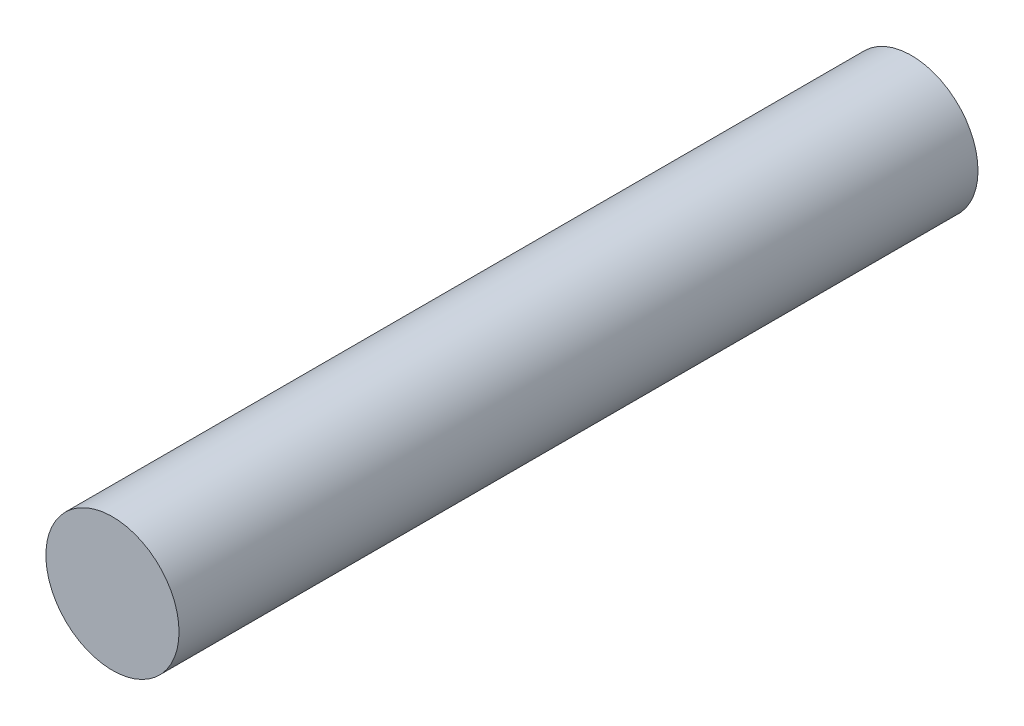
ISO-10303-21;
HEADER;
FILE_DESCRIPTION(('STEP AP214'),'2;1');
FILE_NAME('part.step','',(''),(''),'','','');
FILE_SCHEMA(('AUTOMOTIVE_DESIGN { 1 0 10303 214 1 1 1 1 }'));
ENDSEC;
DATA;
#1=APPLICATION_CONTEXT('core data for automotive mechanical design processes');
#2=APPLICATION_PROTOCOL_DEFINITION('international standard','automotive_design',2000,#1);
#3=PRODUCT_CONTEXT('',#1,'mechanical');
#4=PRODUCT('Part','Part','',(#3));
#5=PRODUCT_RELATED_PRODUCT_CATEGORY('part','',(#4));
#6=PRODUCT_DEFINITION_FORMATION('','',#4);
#7=PRODUCT_DEFINITION_CONTEXT('part definition',#1,'design');
#8=PRODUCT_DEFINITION('design','',#6,#7);
#9=PRODUCT_DEFINITION_SHAPE('','',#8);
#10=(LENGTH_UNIT() NAMED_UNIT(*) SI_UNIT(.MILLI.,.METRE.));
#11=(NAMED_UNIT(*) PLANE_ANGLE_UNIT() SI_UNIT($,.RADIAN.));
#12=(NAMED_UNIT(*) SI_UNIT($,.STERADIAN.) SOLID_ANGLE_UNIT());
#13=UNCERTAINTY_MEASURE_WITH_UNIT(LENGTH_MEASURE(1.E-05),#10,'distance_accuracy_value','');
#14=(GEOMETRIC_REPRESENTATION_CONTEXT(3) GLOBAL_UNCERTAINTY_ASSIGNED_CONTEXT((#13)) GLOBAL_UNIT_ASSIGNED_CONTEXT((#10,
#11,#12)) REPRESENTATION_CONTEXT('',''));
#15=CARTESIAN_POINT('',(0.,0.,0.));
#16=DIRECTION('',(0.,0.,1.));
#17=DIRECTION('',(1.,0.,0.));
#18=AXIS2_PLACEMENT_3D('',#15,#16,#17);
#19=CARTESIAN_POINT('',(0.,0.,15.));
#20=DIRECTION('',(0.,0.,-1.));
#21=DIRECTION('',(-1.,0.,0.));
#22=AXIS2_PLACEMENT_3D('',#19,#20,#21);
#23=CYLINDRICAL_SURFACE('',#22,1.25);
#24=CARTESIAN_POINT('',(0.,0.,15.));
#25=DIRECTION('',(0.,0.,1.));
#26=DIRECTION('',(1.,0.,0.));
#27=AXIS2_PLACEMENT_3D('',#24,#25,#26);
#28=CIRCLE('',#27,1.25);
#29=CARTESIAN_POINT('',(1.25,0.,15.));
#30=VERTEX_POINT('',#29);
#31=EDGE_CURVE('E10',#30,#30,#28,.T.);
#32=ORIENTED_EDGE('',*,*,#31,.F.);
#33=EDGE_LOOP('',(#32));
#34=FACE_BOUND('',#33,.T.);
#35=CARTESIAN_POINT('',(0.,0.,0.));
#36=DIRECTION('',(0.,0.,1.));
#37=DIRECTION('',(1.,0.,0.));
#38=AXIS2_PLACEMENT_3D('',#35,#36,#37);
#39=CIRCLE('',#38,1.25);
#40=CARTESIAN_POINT('',(1.25,0.,0.));
#41=VERTEX_POINT('',#40);
#42=EDGE_CURVE('E33',#41,#41,#39,.T.);
#43=ORIENTED_EDGE('',*,*,#42,.T.);
#44=EDGE_LOOP('',(#43));
#45=FACE_BOUND('',#44,.T.);
#46=ADVANCED_FACE('F30',(#34,#45),#23,.T.);
#47=CARTESIAN_POINT('',(0.,0.,15.));
#48=DIRECTION('',(0.,0.,1.));
#49=DIRECTION('',(1.,0.,0.));
#50=AXIS2_PLACEMENT_3D('',#47,#48,#49);
#51=PLANE('',#50);
#52=ORIENTED_EDGE('',*,*,#31,.T.);
#53=EDGE_LOOP('',(#52));
#54=FACE_BOUND('',#53,.T.);
#55=ADVANCED_FACE('F45',(#54),#51,.T.);
#56=CARTESIAN_POINT('',(0.,0.,0.));
#57=DIRECTION('',(0.,0.,1.));
#58=DIRECTION('',(1.,0.,0.));
#59=AXIS2_PLACEMENT_3D('',#56,#57,#58);
#60=PLANE('',#59);
#61=ORIENTED_EDGE('',*,*,#42,.F.);
#62=EDGE_LOOP('',(#61));
#63=FACE_BOUND('',#62,.T.);
#64=ADVANCED_FACE('F43',(#63),#60,.F.);
#65=CLOSED_SHELL('',(#46,#55,#64));
#66=MANIFOLD_SOLID_BREP('B2',#65);
#67=ADVANCED_BREP_SHAPE_REPRESENTATION('',(#18,#66),#14);
#68=SHAPE_DEFINITION_REPRESENTATION(#9,#67);
ENDSEC;
END-ISO-10303-21;
